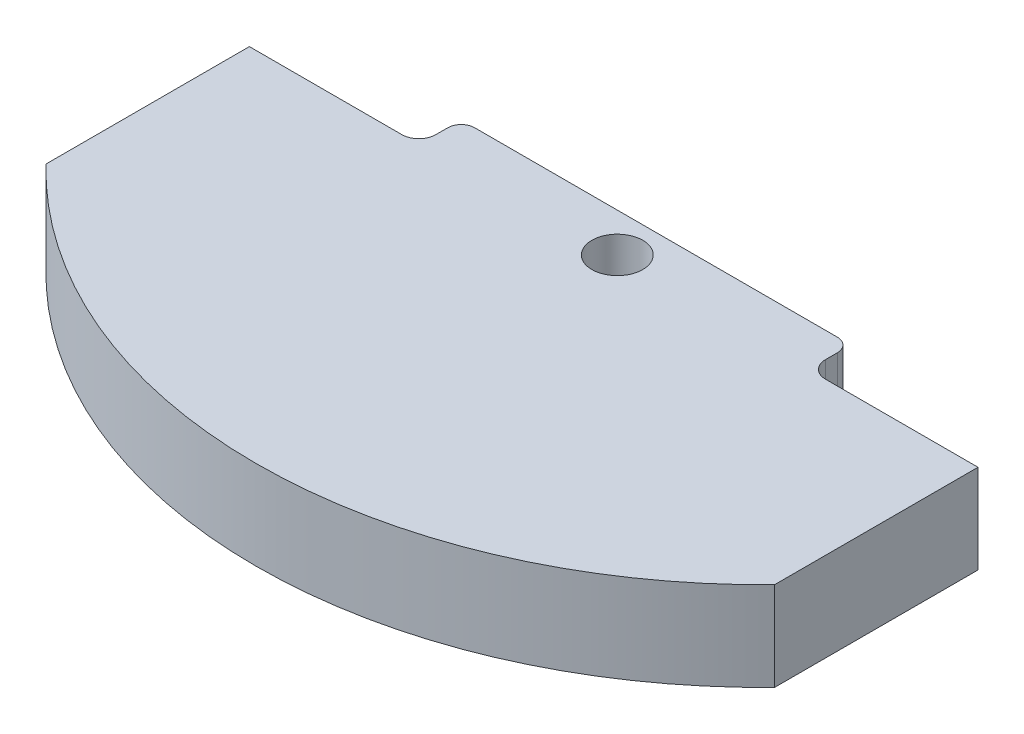
ISO-10303-21;
HEADER;
FILE_DESCRIPTION(('STEP AP214'),'2;1');
FILE_NAME('part.step','',(''),(''),'','','');
FILE_SCHEMA(('AUTOMOTIVE_DESIGN { 1 0 10303 214 1 1 1 1 }'));
ENDSEC;
DATA;
#1=APPLICATION_CONTEXT('core data for automotive mechanical design processes');
#2=APPLICATION_PROTOCOL_DEFINITION('international standard','automotive_design',2000,#1);
#3=PRODUCT_CONTEXT('',#1,'mechanical');
#4=PRODUCT('Part','Part','',(#3));
#5=PRODUCT_RELATED_PRODUCT_CATEGORY('part','',(#4));
#6=PRODUCT_DEFINITION_FORMATION('','',#4);
#7=PRODUCT_DEFINITION_CONTEXT('part definition',#1,'design');
#8=PRODUCT_DEFINITION('design','',#6,#7);
#9=PRODUCT_DEFINITION_SHAPE('','',#8);
#10=(LENGTH_UNIT() NAMED_UNIT(*) SI_UNIT(.MILLI.,.METRE.));
#11=(NAMED_UNIT(*) PLANE_ANGLE_UNIT() SI_UNIT($,.RADIAN.));
#12=(NAMED_UNIT(*) SI_UNIT($,.STERADIAN.) SOLID_ANGLE_UNIT());
#13=UNCERTAINTY_MEASURE_WITH_UNIT(LENGTH_MEASURE(1.E-05),#10,'distance_accuracy_value','');
#14=(GEOMETRIC_REPRESENTATION_CONTEXT(3) GLOBAL_UNCERTAINTY_ASSIGNED_CONTEXT((#13)) GLOBAL_UNIT_ASSIGNED_CONTEXT((#10,
#11,#12)) REPRESENTATION_CONTEXT('',''));
#15=CARTESIAN_POINT('',(0.,0.,0.));
#16=DIRECTION('',(0.,0.,1.));
#17=DIRECTION('',(1.,0.,0.));
#18=AXIS2_PLACEMENT_3D('',#15,#16,#17);
#19=CARTESIAN_POINT('',(0.,13.335,0.));
#20=DIRECTION('',(1.,0.,0.));
#21=DIRECTION('',(0.,0.,-1.));
#22=AXIS2_PLACEMENT_3D('',#19,#20,#21);
#23=PLANE('',#22);
#24=DIRECTION('',(0.,0.,1.));
#25=VECTOR('',#24,1.);
#26=CARTESIAN_POINT('',(0.,13.335,0.));
#27=LINE('',#26,#25);
#28=CARTESIAN_POINT('',(0.,13.335,6.35));
#29=VERTEX_POINT('',#28);
#30=CARTESIAN_POINT('',(0.,13.335,36.83));
#31=VERTEX_POINT('',#30);
#32=EDGE_CURVE('E146',#29,#31,#27,.T.);
#33=ORIENTED_EDGE('',*,*,#32,.F.);
#34=DIRECTION('',(0.,1.,0.));
#35=VECTOR('',#34,1.);
#36=CARTESIAN_POINT('',(0.,0.,6.35));
#37=LINE('',#36,#35);
#38=CARTESIAN_POINT('',(0.,0.,6.35));
#39=VERTEX_POINT('',#38);
#40=EDGE_CURVE('E132',#39,#29,#37,.T.);
#41=ORIENTED_EDGE('',*,*,#40,.F.);
#42=DIRECTION('',(0.,0.,1.));
#43=VECTOR('',#42,1.);
#44=CARTESIAN_POINT('',(0.,0.,0.));
#45=LINE('',#44,#43);
#46=CARTESIAN_POINT('',(0.,0.,36.83));
#47=VERTEX_POINT('',#46);
#48=EDGE_CURVE('E144',#39,#47,#45,.T.);
#49=ORIENTED_EDGE('',*,*,#48,.T.);
#50=DIRECTION('',(0.,-1.,0.));
#51=VECTOR('',#50,1.);
#52=CARTESIAN_POINT('',(0.,13.335,36.83));
#53=LINE('',#52,#51);
#54=EDGE_CURVE('E166',#31,#47,#53,.T.);
#55=ORIENTED_EDGE('',*,*,#54,.F.);
#56=EDGE_LOOP('',(#33,#41,#49,#55));
#57=FACE_BOUND('',#56,.T.);
#58=ADVANCED_FACE('F39',(#57),#23,.F.);
#59=CARTESIAN_POINT('',(54.5973,13.335,-16.0390347245909));
#60=DIRECTION('',(0.,-1.,0.));
#61=DIRECTION('',(0.,0.,-1.));
#62=AXIS2_PLACEMENT_3D('',#59,#60,#61);
#63=CYLINDRICAL_SURFACE('',#62,76.);
#64=CARTESIAN_POINT('',(54.5973,0.,-16.0390347245909));
#65=DIRECTION('',(0.,1.,0.));
#66=DIRECTION('',(0.,0.,-1.));
#67=AXIS2_PLACEMENT_3D('',#64,#65,#66);
#68=CIRCLE('',#67,76.);
#69=CARTESIAN_POINT('',(109.1946,0.,36.83));
#70=VERTEX_POINT('',#69);
#71=EDGE_CURVE('E150',#47,#70,#68,.T.);
#72=ORIENTED_EDGE('',*,*,#71,.T.);
#73=DIRECTION('',(0.,-1.,0.));
#74=VECTOR('',#73,1.);
#75=CARTESIAN_POINT('',(109.1946,13.335,36.83));
#76=LINE('',#75,#74);
#77=CARTESIAN_POINT('',(109.1946,13.335,36.83));
#78=VERTEX_POINT('',#77);
#79=EDGE_CURVE('E163',#78,#70,#76,.T.);
#80=ORIENTED_EDGE('',*,*,#79,.F.);
#81=CARTESIAN_POINT('',(54.5973,13.335,-16.0390347245909));
#82=DIRECTION('',(0.,1.,0.));
#83=DIRECTION('',(0.,0.,-1.));
#84=AXIS2_PLACEMENT_3D('',#81,#82,#83);
#85=CIRCLE('',#84,76.);
#86=EDGE_CURVE('E224',#31,#78,#85,.T.);
#87=ORIENTED_EDGE('',*,*,#86,.F.);
#88=ORIENTED_EDGE('',*,*,#54,.T.);
#89=EDGE_LOOP('',(#72,#80,#87,#88));
#90=FACE_BOUND('',#89,.T.);
#91=ADVANCED_FACE('F266',(#90),#63,.T.);
#92=CARTESIAN_POINT('',(109.1946,13.335,0.));
#93=DIRECTION('',(-1.,0.,0.));
#94=DIRECTION('',(0.,0.,1.));
#95=AXIS2_PLACEMENT_3D('',#92,#93,#94);
#96=PLANE('',#95);
#97=DIRECTION('',(0.,0.,-1.));
#98=VECTOR('',#97,1.);
#99=CARTESIAN_POINT('',(109.1946,0.,0.));
#100=LINE('',#99,#98);
#101=CARTESIAN_POINT('',(109.1946,0.,6.34999999999999));
#102=VERTEX_POINT('',#101);
#103=EDGE_CURVE('E153',#70,#102,#100,.T.);
#104=ORIENTED_EDGE('',*,*,#103,.T.);
#105=DIRECTION('',(0.,1.,0.));
#106=VECTOR('',#105,1.);
#107=CARTESIAN_POINT('',(109.1946,0.,6.34999999999999));
#108=LINE('',#107,#106);
#109=CARTESIAN_POINT('',(109.1946,13.335,6.34999999999999));
#110=VERTEX_POINT('',#109);
#111=EDGE_CURVE('E231',#102,#110,#108,.T.);
#112=ORIENTED_EDGE('',*,*,#111,.T.);
#113=DIRECTION('',(0.,0.,-1.));
#114=VECTOR('',#113,1.);
#115=CARTESIAN_POINT('',(109.1946,13.335,0.));
#116=LINE('',#115,#114);
#117=EDGE_CURVE('E222',#78,#110,#116,.T.);
#118=ORIENTED_EDGE('',*,*,#117,.F.);
#119=ORIENTED_EDGE('',*,*,#79,.T.);
#120=EDGE_LOOP('',(#104,#112,#118,#119));
#121=FACE_BOUND('',#120,.T.);
#122=ADVANCED_FACE('F272',(#121),#96,.F.);
#123=CARTESIAN_POINT('',(0.,13.335,0.));
#124=DIRECTION('',(0.,0.,1.));
#125=DIRECTION('',(1.,0.,0.));
#126=AXIS2_PLACEMENT_3D('',#123,#124,#125);
#127=PLANE('',#126);
#128=DIRECTION('',(-1.,0.,0.));
#129=VECTOR('',#128,1.);
#130=CARTESIAN_POINT('',(0.,13.335,0.));
#131=LINE('',#130,#129);
#132=CARTESIAN_POINT('',(81.7626,13.335,0.));
#133=VERTEX_POINT('',#132);
#134=CARTESIAN_POINT('',(27.432,13.335,0.));
#135=VERTEX_POINT('',#134);
#136=EDGE_CURVE('E156',#133,#135,#131,.T.);
#137=ORIENTED_EDGE('',*,*,#136,.F.);
#138=DIRECTION('',(0.,1.,0.));
#139=VECTOR('',#138,1.);
#140=CARTESIAN_POINT('',(81.7626,13.335,0.));
#141=LINE('',#140,#139);
#142=CARTESIAN_POINT('',(81.7626,0.,0.));
#143=VERTEX_POINT('',#142);
#144=EDGE_CURVE('E197',#133,#143,#141,.F.);
#145=ORIENTED_EDGE('',*,*,#144,.T.);
#146=DIRECTION('',(-1.,0.,0.));
#147=VECTOR('',#146,1.);
#148=CARTESIAN_POINT('',(0.,0.,0.));
#149=LINE('',#148,#147);
#150=CARTESIAN_POINT('',(27.432,0.,0.));
#151=VERTEX_POINT('',#150);
#152=EDGE_CURVE('E161',#143,#151,#149,.T.);
#153=ORIENTED_EDGE('',*,*,#152,.T.);
#154=DIRECTION('',(0.,1.,0.));
#155=VECTOR('',#154,1.);
#156=CARTESIAN_POINT('',(27.432,13.335,0.));
#157=LINE('',#156,#155);
#158=EDGE_CURVE('E194',#151,#135,#157,.T.);
#159=ORIENTED_EDGE('',*,*,#158,.T.);
#160=EDGE_LOOP('',(#137,#145,#153,#159));
#161=FACE_BOUND('',#160,.T.);
#162=ADVANCED_FACE('F220',(#161),#127,.F.);
#163=CARTESIAN_POINT('',(54.5973,13.335,-16.0390347245909));
#164=DIRECTION('',(0.,-1.,0.));
#165=DIRECTION('',(0.,0.,-1.));
#166=AXIS2_PLACEMENT_3D('',#163,#164,#165);
#167=PLANE('',#166);
#168=CARTESIAN_POINT('',(54.61,13.335,5.81937520300735));
#169=DIRECTION('',(0.,-1.,0.));
#170=DIRECTION('',(0.,0.,-1.));
#171=AXIS2_PLACEMENT_3D('',#168,#169,#170);
#172=CIRCLE('',#171,3.81);
#173=CARTESIAN_POINT('',(54.61,13.335,2.00937520300735));
#174=VERTEX_POINT('',#173);
#175=EDGE_CURVE('E236',#174,#174,#172,.T.);
#176=ORIENTED_EDGE('',*,*,#175,.T.);
#177=EDGE_LOOP('',(#176));
#178=FACE_BOUND('',#177,.T.);
#179=DIRECTION('',(0.,0.,1.));
#180=VECTOR('',#179,1.);
#181=CARTESIAN_POINT('',(83.7946,13.335,0.));
#182=LINE('',#181,#180);
#183=CARTESIAN_POINT('',(83.7946,13.335,2.032));
#184=VERTEX_POINT('',#183);
#185=CARTESIAN_POINT('',(83.7946,13.335,3.80999999999999));
#186=VERTEX_POINT('',#185);
#187=EDGE_CURVE('E218',#184,#186,#182,.T.);
#188=ORIENTED_EDGE('',*,*,#187,.F.);
#189=CARTESIAN_POINT('',(81.7626,13.335,2.032));
#190=DIRECTION('',(0.,-1.,0.));
#191=DIRECTION('',(0.,0.,-1.));
#192=AXIS2_PLACEMENT_3D('',#189,#190,#191);
#193=CIRCLE('',#192,2.032);
#194=EDGE_CURVE('E192',#184,#133,#193,.F.);
#195=ORIENTED_EDGE('',*,*,#194,.T.);
#196=ORIENTED_EDGE('',*,*,#136,.T.);
#197=CARTESIAN_POINT('',(27.432,13.335,2.032));
#198=DIRECTION('',(0.,-1.,0.));
#199=DIRECTION('',(0.,0.,-1.));
#200=AXIS2_PLACEMENT_3D('',#197,#198,#199);
#201=CIRCLE('',#200,2.032);
#202=CARTESIAN_POINT('',(25.4,13.335,2.032));
#203=VERTEX_POINT('',#202);
#204=EDGE_CURVE('E190',#135,#203,#201,.F.);
#205=ORIENTED_EDGE('',*,*,#204,.T.);
#206=DIRECTION('',(0.,0.,-1.));
#207=VECTOR('',#206,1.);
#208=CARTESIAN_POINT('',(25.4,13.335,0.));
#209=LINE('',#208,#207);
#210=CARTESIAN_POINT('',(25.4,13.335,3.81));
#211=VERTEX_POINT('',#210);
#212=EDGE_CURVE('E139',#211,#203,#209,.T.);
#213=ORIENTED_EDGE('',*,*,#212,.F.);
#214=CARTESIAN_POINT('',(22.86,13.335,3.81));
#215=DIRECTION('',(0.,-1.,0.));
#216=DIRECTION('',(0.,0.,-1.));
#217=AXIS2_PLACEMENT_3D('',#214,#215,#216);
#218=CIRCLE('',#217,2.54);
#219=CARTESIAN_POINT('',(22.86,13.335,6.35));
#220=VERTEX_POINT('',#219);
#221=EDGE_CURVE('E183',#211,#220,#218,.T.);
#222=ORIENTED_EDGE('',*,*,#221,.T.);
#223=DIRECTION('',(1.,0.,0.));
#224=VECTOR('',#223,1.);
#225=CARTESIAN_POINT('',(0.,13.335,6.35));
#226=LINE('',#225,#224);
#227=EDGE_CURVE('E233',#29,#220,#226,.T.);
#228=ORIENTED_EDGE('',*,*,#227,.F.);
#229=ORIENTED_EDGE('',*,*,#32,.T.);
#230=ORIENTED_EDGE('',*,*,#86,.T.);
#231=ORIENTED_EDGE('',*,*,#117,.T.);
#232=DIRECTION('',(1.,0.,0.));
#233=VECTOR('',#232,1.);
#234=CARTESIAN_POINT('',(109.1946,13.335,6.34999999999999));
#235=LINE('',#234,#233);
#236=CARTESIAN_POINT('',(86.3346,13.335,6.34999999999999));
#237=VERTEX_POINT('',#236);
#238=EDGE_CURVE('E210',#237,#110,#235,.T.);
#239=ORIENTED_EDGE('',*,*,#238,.F.);
#240=CARTESIAN_POINT('',(86.3346,13.335,3.80999999999999));
#241=DIRECTION('',(0.,-1.,0.));
#242=DIRECTION('',(0.,0.,-1.));
#243=AXIS2_PLACEMENT_3D('',#240,#241,#242);
#244=CIRCLE('',#243,2.54);
#245=EDGE_CURVE('E178',#237,#186,#244,.T.);
#246=ORIENTED_EDGE('',*,*,#245,.T.);
#247=EDGE_LOOP('',(#188,#195,#196,#205,#213,#222,#228,#229,#230,#231,#239,#246));
#248=FACE_BOUND('',#247,.T.);
#249=ADVANCED_FACE('F217',(#178,#248),#167,.F.);
#250=CARTESIAN_POINT('',(54.5973,0.,-16.0390347245909));
#251=DIRECTION('',(0.,-1.,0.));
#252=DIRECTION('',(0.,0.,-1.));
#253=AXIS2_PLACEMENT_3D('',#250,#251,#252);
#254=PLANE('',#253);
#255=CARTESIAN_POINT('',(54.61,0.,5.81937520300735));
#256=DIRECTION('',(0.,-1.,0.));
#257=DIRECTION('',(0.,0.,-1.));
#258=AXIS2_PLACEMENT_3D('',#255,#256,#257);
#259=CIRCLE('',#258,3.81);
#260=CARTESIAN_POINT('',(54.61,0.,2.00937520300735));
#261=VERTEX_POINT('',#260);
#262=EDGE_CURVE('E241',#261,#261,#259,.T.);
#263=ORIENTED_EDGE('',*,*,#262,.F.);
#264=EDGE_LOOP('',(#263));
#265=FACE_BOUND('',#264,.T.);
#266=ORIENTED_EDGE('',*,*,#152,.F.);
#267=CARTESIAN_POINT('',(81.7626,0.,2.032));
#268=DIRECTION('',(0.,-1.,0.));
#269=DIRECTION('',(0.,0.,-1.));
#270=AXIS2_PLACEMENT_3D('',#267,#268,#269);
#271=CIRCLE('',#270,2.032);
#272=CARTESIAN_POINT('',(83.7946,0.,2.032));
#273=VERTEX_POINT('',#272);
#274=EDGE_CURVE('E47',#143,#273,#271,.T.);
#275=ORIENTED_EDGE('',*,*,#274,.T.);
#276=DIRECTION('',(0.,0.,1.));
#277=VECTOR('',#276,1.);
#278=CARTESIAN_POINT('',(83.7946,0.,0.));
#279=LINE('',#278,#277);
#280=CARTESIAN_POINT('',(83.7946,0.,3.80999999999999));
#281=VERTEX_POINT('',#280);
#282=EDGE_CURVE('E201',#273,#281,#279,.T.);
#283=ORIENTED_EDGE('',*,*,#282,.T.);
#284=CARTESIAN_POINT('',(86.3346,0.,3.80999999999999));
#285=DIRECTION('',(0.,-1.,0.));
#286=DIRECTION('',(0.,0.,-1.));
#287=AXIS2_PLACEMENT_3D('',#284,#285,#286);
#288=CIRCLE('',#287,2.54);
#289=CARTESIAN_POINT('',(86.3346,0.,6.34999999999999));
#290=VERTEX_POINT('',#289);
#291=EDGE_CURVE('E181',#281,#290,#288,.F.);
#292=ORIENTED_EDGE('',*,*,#291,.T.);
#293=DIRECTION('',(1.,0.,0.));
#294=VECTOR('',#293,1.);
#295=CARTESIAN_POINT('',(109.1946,0.,6.34999999999999));
#296=LINE('',#295,#294);
#297=EDGE_CURVE('E211',#290,#102,#296,.T.);
#298=ORIENTED_EDGE('',*,*,#297,.T.);
#299=ORIENTED_EDGE('',*,*,#103,.F.);
#300=ORIENTED_EDGE('',*,*,#71,.F.);
#301=ORIENTED_EDGE('',*,*,#48,.F.);
#302=DIRECTION('',(1.,0.,0.));
#303=VECTOR('',#302,1.);
#304=CARTESIAN_POINT('',(0.,0.,6.35));
#305=LINE('',#304,#303);
#306=CARTESIAN_POINT('',(22.86,0.,6.35));
#307=VERTEX_POINT('',#306);
#308=EDGE_CURVE('E128',#39,#307,#305,.T.);
#309=ORIENTED_EDGE('',*,*,#308,.T.);
#310=CARTESIAN_POINT('',(22.86,0.,3.81));
#311=DIRECTION('',(0.,-1.,0.));
#312=DIRECTION('',(0.,0.,-1.));
#313=AXIS2_PLACEMENT_3D('',#310,#311,#312);
#314=CIRCLE('',#313,2.54);
#315=CARTESIAN_POINT('',(25.4,0.,3.81));
#316=VERTEX_POINT('',#315);
#317=EDGE_CURVE('E185',#307,#316,#314,.F.);
#318=ORIENTED_EDGE('',*,*,#317,.T.);
#319=DIRECTION('',(0.,0.,-1.));
#320=VECTOR('',#319,1.);
#321=CARTESIAN_POINT('',(25.4,0.,0.));
#322=LINE('',#321,#320);
#323=CARTESIAN_POINT('',(25.4,0.,2.032));
#324=VERTEX_POINT('',#323);
#325=EDGE_CURVE('E138',#316,#324,#322,.T.);
#326=ORIENTED_EDGE('',*,*,#325,.T.);
#327=CARTESIAN_POINT('',(27.432,0.,2.032));
#328=DIRECTION('',(0.,-1.,0.));
#329=DIRECTION('',(0.,0.,-1.));
#330=AXIS2_PLACEMENT_3D('',#327,#328,#329);
#331=CIRCLE('',#330,2.032);
#332=EDGE_CURVE('E59',#324,#151,#331,.T.);
#333=ORIENTED_EDGE('',*,*,#332,.T.);
#334=EDGE_LOOP('',(#266,#275,#283,#292,#298,#299,#300,#301,#309,#318,#326,#333));
#335=FACE_BOUND('',#334,.T.);
#336=ADVANCED_FACE('F148',(#265,#335),#254,.T.);
#337=CARTESIAN_POINT('',(109.1946,0.,6.34999999999999));
#338=DIRECTION('',(0.,0.,1.));
#339=DIRECTION('',(1.,0.,0.));
#340=AXIS2_PLACEMENT_3D('',#337,#338,#339);
#341=PLANE('',#340);
#342=ORIENTED_EDGE('',*,*,#297,.F.);
#343=DIRECTION('',(0.,1.,0.));
#344=VECTOR('',#343,1.);
#345=CARTESIAN_POINT('',(86.3346,13.335,6.34999999999999));
#346=LINE('',#345,#344);
#347=EDGE_CURVE('E168',#290,#237,#346,.T.);
#348=ORIENTED_EDGE('',*,*,#347,.T.);
#349=ORIENTED_EDGE('',*,*,#238,.T.);
#350=ORIENTED_EDGE('',*,*,#111,.F.);
#351=EDGE_LOOP('',(#342,#348,#349,#350));
#352=FACE_BOUND('',#351,.T.);
#353=ADVANCED_FACE('F255',(#352),#341,.F.);
#354=CARTESIAN_POINT('',(83.7946,0.,0.));
#355=DIRECTION('',(-1.,0.,0.));
#356=DIRECTION('',(0.,0.,1.));
#357=AXIS2_PLACEMENT_3D('',#354,#355,#356);
#358=PLANE('',#357);
#359=ORIENTED_EDGE('',*,*,#282,.F.);
#360=DIRECTION('',(0.,1.,0.));
#361=VECTOR('',#360,1.);
#362=CARTESIAN_POINT('',(83.7946,0.,2.032));
#363=LINE('',#362,#361);
#364=EDGE_CURVE('E187',#273,#184,#363,.T.);
#365=ORIENTED_EDGE('',*,*,#364,.T.);
#366=ORIENTED_EDGE('',*,*,#187,.T.);
#367=DIRECTION('',(0.,1.,0.));
#368=VECTOR('',#367,1.);
#369=CARTESIAN_POINT('',(83.7946,0.,3.80999999999999));
#370=LINE('',#369,#368);
#371=EDGE_CURVE('E171',#186,#281,#370,.F.);
#372=ORIENTED_EDGE('',*,*,#371,.T.);
#373=EDGE_LOOP('',(#359,#365,#366,#372));
#374=FACE_BOUND('',#373,.T.);
#375=ADVANCED_FACE('F206',(#374),#358,.F.);
#376=CARTESIAN_POINT('',(25.4,0.,0.));
#377=DIRECTION('',(1.,0.,0.));
#378=DIRECTION('',(0.,0.,-1.));
#379=AXIS2_PLACEMENT_3D('',#376,#377,#378);
#380=PLANE('',#379);
#381=ORIENTED_EDGE('',*,*,#212,.T.);
#382=DIRECTION('',(0.,1.,0.));
#383=VECTOR('',#382,1.);
#384=CARTESIAN_POINT('',(25.4,0.,2.032));
#385=LINE('',#384,#383);
#386=EDGE_CURVE('E11',#203,#324,#385,.F.);
#387=ORIENTED_EDGE('',*,*,#386,.T.);
#388=ORIENTED_EDGE('',*,*,#325,.F.);
#389=DIRECTION('',(0.,1.,0.));
#390=VECTOR('',#389,1.);
#391=CARTESIAN_POINT('',(25.4,13.335,3.81));
#392=LINE('',#391,#390);
#393=EDGE_CURVE('E174',#316,#211,#392,.T.);
#394=ORIENTED_EDGE('',*,*,#393,.T.);
#395=EDGE_LOOP('',(#381,#387,#388,#394));
#396=FACE_BOUND('',#395,.T.);
#397=ADVANCED_FACE('F293',(#396),#380,.F.);
#398=CARTESIAN_POINT('',(0.,0.,6.35));
#399=DIRECTION('',(0.,0.,1.));
#400=DIRECTION('',(1.,0.,0.));
#401=AXIS2_PLACEMENT_3D('',#398,#399,#400);
#402=PLANE('',#401);
#403=ORIENTED_EDGE('',*,*,#227,.T.);
#404=DIRECTION('',(0.,1.,0.));
#405=VECTOR('',#404,1.);
#406=CARTESIAN_POINT('',(22.86,0.,6.35));
#407=LINE('',#406,#405);
#408=EDGE_CURVE('E135',#220,#307,#407,.F.);
#409=ORIENTED_EDGE('',*,*,#408,.T.);
#410=ORIENTED_EDGE('',*,*,#308,.F.);
#411=ORIENTED_EDGE('',*,*,#40,.T.);
#412=EDGE_LOOP('',(#403,#409,#410,#411));
#413=FACE_BOUND('',#412,.T.);
#414=ADVANCED_FACE('F131',(#413),#402,.F.);
#415=CARTESIAN_POINT('',(86.3346,0.,3.80999999999999));
#416=DIRECTION('',(0.,-1.,0.));
#417=DIRECTION('',(0.,0.,-1.));
#418=AXIS2_PLACEMENT_3D('',#415,#416,#417);
#419=CYLINDRICAL_SURFACE('',#418,2.54);
#420=ORIENTED_EDGE('',*,*,#291,.F.);
#421=ORIENTED_EDGE('',*,*,#371,.F.);
#422=ORIENTED_EDGE('',*,*,#245,.F.);
#423=ORIENTED_EDGE('',*,*,#347,.F.);
#424=EDGE_LOOP('',(#420,#421,#422,#423));
#425=FACE_BOUND('',#424,.T.);
#426=ADVANCED_FACE('F277',(#425),#419,.F.);
#427=CARTESIAN_POINT('',(22.86,0.,3.81));
#428=DIRECTION('',(0.,-1.,0.));
#429=DIRECTION('',(0.,0.,-1.));
#430=AXIS2_PLACEMENT_3D('',#427,#428,#429);
#431=CYLINDRICAL_SURFACE('',#430,2.54);
#432=ORIENTED_EDGE('',*,*,#317,.F.);
#433=ORIENTED_EDGE('',*,*,#408,.F.);
#434=ORIENTED_EDGE('',*,*,#221,.F.);
#435=ORIENTED_EDGE('',*,*,#393,.F.);
#436=EDGE_LOOP('',(#432,#433,#434,#435));
#437=FACE_BOUND('',#436,.T.);
#438=ADVANCED_FACE('F280',(#437),#431,.F.);
#439=CARTESIAN_POINT('',(81.7626,0.,2.032));
#440=DIRECTION('',(0.,1.,0.));
#441=DIRECTION('',(0.,0.,1.));
#442=AXIS2_PLACEMENT_3D('',#439,#440,#441);
#443=CYLINDRICAL_SURFACE('',#442,2.032);
#444=ORIENTED_EDGE('',*,*,#274,.F.);
#445=ORIENTED_EDGE('',*,*,#144,.F.);
#446=ORIENTED_EDGE('',*,*,#194,.F.);
#447=ORIENTED_EDGE('',*,*,#364,.F.);
#448=EDGE_LOOP('',(#444,#445,#446,#447));
#449=FACE_BOUND('',#448,.T.);
#450=ADVANCED_FACE('F213',(#449),#443,.T.);
#451=CARTESIAN_POINT('',(27.432,13.335,2.032));
#452=DIRECTION('',(0.,1.,0.));
#453=DIRECTION('',(0.,0.,1.));
#454=AXIS2_PLACEMENT_3D('',#451,#452,#453);
#455=CYLINDRICAL_SURFACE('',#454,2.032);
#456=ORIENTED_EDGE('',*,*,#332,.F.);
#457=ORIENTED_EDGE('',*,*,#386,.F.);
#458=ORIENTED_EDGE('',*,*,#204,.F.);
#459=ORIENTED_EDGE('',*,*,#158,.F.);
#460=EDGE_LOOP('',(#456,#457,#458,#459));
#461=FACE_BOUND('',#460,.T.);
#462=ADVANCED_FACE('F41',(#461),#455,.T.);
#463=CARTESIAN_POINT('',(54.61,13.335,5.81937520300735));
#464=DIRECTION('',(0.,-1.,0.));
#465=DIRECTION('',(0.,0.,-1.));
#466=AXIS2_PLACEMENT_3D('',#463,#464,#465);
#467=CYLINDRICAL_SURFACE('',#466,3.81);
#468=ORIENTED_EDGE('',*,*,#175,.F.);
#469=EDGE_LOOP('',(#468));
#470=FACE_BOUND('',#469,.T.);
#471=ORIENTED_EDGE('',*,*,#262,.T.);
#472=EDGE_LOOP('',(#471));
#473=FACE_BOUND('',#472,.T.);
#474=ADVANCED_FACE('F248',(#470,#473),#467,.F.);
#475=CLOSED_SHELL('',(#58,#91,#122,#162,#249,#336,#353,#375,#397,#414,#426,#438,#450,#462,#474));
#476=MANIFOLD_SOLID_BREP('B2',#475);
#477=ADVANCED_BREP_SHAPE_REPRESENTATION('',(#18,#476),#14);
#478=SHAPE_DEFINITION_REPRESENTATION(#9,#477);
ENDSEC;
END-ISO-10303-21;
